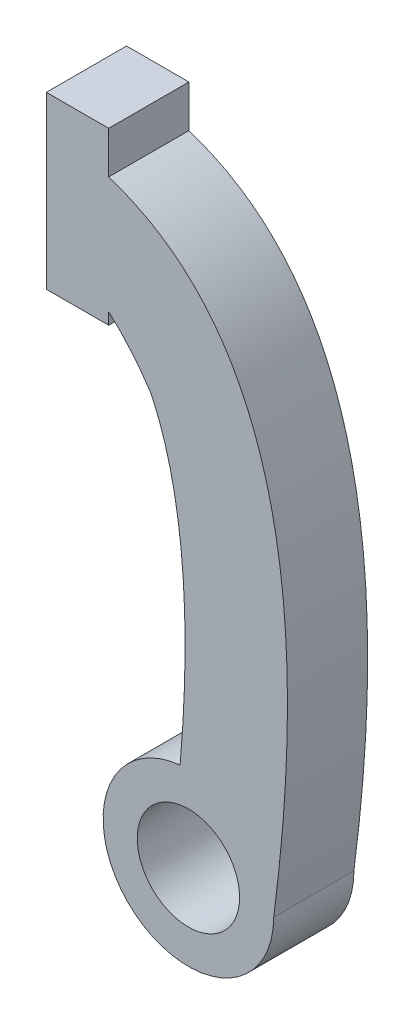
ISO-10303-21;
HEADER;
FILE_DESCRIPTION(('STEP AP214'),'2;1');
FILE_NAME('part.step','',(''),(''),'','','');
FILE_SCHEMA(('AUTOMOTIVE_DESIGN { 1 0 10303 214 1 1 1 1 }'));
ENDSEC;
DATA;
#1=APPLICATION_CONTEXT('core data for automotive mechanical design processes');
#2=APPLICATION_PROTOCOL_DEFINITION('international standard','automotive_design',2000,#1);
#3=PRODUCT_CONTEXT('',#1,'mechanical');
#4=PRODUCT('Part','Part','',(#3));
#5=PRODUCT_RELATED_PRODUCT_CATEGORY('part','',(#4));
#6=PRODUCT_DEFINITION_FORMATION('','',#4);
#7=PRODUCT_DEFINITION_CONTEXT('part definition',#1,'design');
#8=PRODUCT_DEFINITION('design','',#6,#7);
#9=PRODUCT_DEFINITION_SHAPE('','',#8);
#10=(LENGTH_UNIT() NAMED_UNIT(*) SI_UNIT(.MILLI.,.METRE.));
#11=(NAMED_UNIT(*) PLANE_ANGLE_UNIT() SI_UNIT($,.RADIAN.));
#12=(NAMED_UNIT(*) SI_UNIT($,.STERADIAN.) SOLID_ANGLE_UNIT());
#13=UNCERTAINTY_MEASURE_WITH_UNIT(LENGTH_MEASURE(1.E-05),#10,'distance_accuracy_value','');
#14=(GEOMETRIC_REPRESENTATION_CONTEXT(3) GLOBAL_UNCERTAINTY_ASSIGNED_CONTEXT((#13)) GLOBAL_UNIT_ASSIGNED_CONTEXT((#10,
#11,#12)) REPRESENTATION_CONTEXT('',''));
#15=CARTESIAN_POINT('',(0.,0.,0.));
#16=DIRECTION('',(0.,0.,1.));
#17=DIRECTION('',(1.,0.,0.));
#18=AXIS2_PLACEMENT_3D('',#15,#16,#17);
#19=CARTESIAN_POINT('',(-22.0822946516425,230.189836253695,47.));
#20=CARTESIAN_POINT('',(-40.6908836474442,258.14906543191,47.));
#21=CARTESIAN_POINT('',(-65.,272.119188354956,47.));
#22=B_SPLINE_CURVE_WITH_KNOTS('',2,(#19,#20,#21),.UNSPECIFIED.,.F.,.F.,(3,3),(0.,
0.333581844016435),.UNSPECIFIED.);
#23=DIRECTION('',(0.,0.,-1.));
#24=VECTOR('',#23,1.);
#25=SURFACE_OF_LINEAR_EXTRUSION('',#22,#24);
#26=CARTESIAN_POINT('',(-22.0822946516425,230.189836253695,0.));
#27=CARTESIAN_POINT('',(-40.6908836474442,258.14906543191,0.));
#28=CARTESIAN_POINT('',(-65.,272.119188354956,0.));
#29=B_SPLINE_CURVE_WITH_KNOTS('',2,(#26,#27,#28),.UNSPECIFIED.,.F.,.F.,(3,3),(0.,
0.333581844016435),.UNSPECIFIED.);
#30=CARTESIAN_POINT('',(-22.0822946516425,230.189836253695,0.));
#31=VERTEX_POINT('',#30);
#32=CARTESIAN_POINT('',(-46.727102690925,258.937140002278,0.));
#33=VERTEX_POINT('',#32);
#34=EDGE_CURVE('E138',#31,#33,#29,.T.);
#35=ORIENTED_EDGE('',*,*,#34,.F.);
#36=DIRECTION('',(0.,0.,-1.));
#37=VECTOR('',#36,1.);
#38=CARTESIAN_POINT('',(-22.0822946516425,230.189836253695,47.));
#39=LINE('',#38,#37);
#40=CARTESIAN_POINT('',(-22.0822946516425,230.189836253695,47.));
#41=VERTEX_POINT('',#40);
#42=EDGE_CURVE('E11',#41,#31,#39,.T.);
#43=ORIENTED_EDGE('',*,*,#42,.F.);
#44=CARTESIAN_POINT('',(-46.727102690925,258.937140002278,47.));
#45=VERTEX_POINT('',#44);
#46=EDGE_CURVE('E178',#41,#45,#22,.T.);
#47=ORIENTED_EDGE('',*,*,#46,.T.);
#48=DIRECTION('',(0.,0.,-1.));
#49=VECTOR('',#48,1.);
#50=CARTESIAN_POINT('',(-46.727102690925,258.937140002278,47.));
#51=LINE('',#50,#49);
#52=EDGE_CURVE('E51',#45,#33,#51,.T.);
#53=ORIENTED_EDGE('',*,*,#52,.T.);
#54=EDGE_LOOP('',(#35,#43,#47,#53));
#55=FACE_BOUND('',#54,.T.);
#56=ADVANCED_FACE('F34',(#55),#25,.T.);
#57=CARTESIAN_POINT('',(-9.49357337631064,7.77912121756313,47.));
#58=CARTESIAN_POINT('',(-9.27147188635676,9.47772070200445,47.));
#59=CARTESIAN_POINT('',(-8.83348745722547,12.8883812125781,47.));
#60=CARTESIAN_POINT('',(-8.0018303506311,19.6141984633931,47.));
#61=CARTESIAN_POINT('',(-7.03622253540502,27.9108070706155,47.));
#62=CARTESIAN_POINT('',(-5.99817104725146,37.6671472912994,47.));
#63=CARTESIAN_POINT('',(-4.77327923321823,50.4157577348247,47.));
#64=CARTESIAN_POINT('',(-3.53961801330322,65.8581203766924,47.));
#65=CARTESIAN_POINT('',(-2.52936637816039,83.5913905702309,47.));
#66=CARTESIAN_POINT('',(-1.98232047610912,100.516724073032,47.));
#67=CARTESIAN_POINT('',(-1.85878936172137,121.992140620998,47.));
#68=CARTESIAN_POINT('',(-2.8149789430919,146.760764163244,47.));
#69=CARTESIAN_POINT('',(-5.15688622075544,168.679611703463,47.));
#70=CARTESIAN_POINT('',(-7.77567131366234,184.458623380657,47.));
#71=CARTESIAN_POINT('',(-10.0839012903231,195.406366157599,47.));
#72=CARTESIAN_POINT('',(-12.7042918977025,205.462363582975,47.));
#73=CARTESIAN_POINT('',(-15.1176756212418,213.099806620311,47.));
#74=CARTESIAN_POINT('',(-17.1659673713187,218.768249547536,47.));
#75=CARTESIAN_POINT('',(-18.75625372079,222.802063426017,47.));
#76=CARTESIAN_POINT('',(-20.120456476122,225.981036835896,47.));
#77=CARTESIAN_POINT('',(-21.2365276539284,228.424580455262,47.));
#78=CARTESIAN_POINT('',(-21.7957330475991,229.599816850209,47.));
#79=CARTESIAN_POINT('',(-22.0822946516425,230.189836253695,47.));
#80=B_SPLINE_CURVE_WITH_KNOTS('',3,(#57,#58,#59,#60,#61,#62,#63,#64,#65,#66,#67,#68,#69,#70,#71,
#72,#73,#74,#75,#76,#77,#78,#79),.UNSPECIFIED.,.F.,.F.,(4,1,1,1,1,1,1,1,1,1,1,1,1,1,1,1,1,1,1,1,
4),(0.,0.00732301292553175,0.0146460258510635,0.029292051702127,0.0439380775531905,
0.058584103404254,0.087876155106381,0.117168206808508,0.146460258510635,0.175752310212762,
0.234336413617016,0.29292051702127,0.322212568723397,0.351504620425524,0.380796672127651,
0.410088723829778,0.424734749680841,0.439380775531905,0.454026801382968,0.4613498143085,
0.468672827234032),.UNSPECIFIED.);
#81=DIRECTION('',(0.,0.,-1.));
#82=VECTOR('',#81,1.);
#83=SURFACE_OF_LINEAR_EXTRUSION('',#80,#82);
#84=CARTESIAN_POINT('',(-9.49357337631064,7.77912121756313,0.));
#85=CARTESIAN_POINT('',(-9.27147188635676,9.47772070200445,0.));
#86=CARTESIAN_POINT('',(-8.83348745722547,12.8883812125781,0.));
#87=CARTESIAN_POINT('',(-8.0018303506311,19.6141984633931,0.));
#88=CARTESIAN_POINT('',(-7.03622253540502,27.9108070706155,0.));
#89=CARTESIAN_POINT('',(-5.99817104725146,37.6671472912994,0.));
#90=CARTESIAN_POINT('',(-4.77327923321823,50.4157577348247,0.));
#91=CARTESIAN_POINT('',(-3.53961801330322,65.8581203766924,0.));
#92=CARTESIAN_POINT('',(-2.52936637816039,83.5913905702309,0.));
#93=CARTESIAN_POINT('',(-1.98232047610912,100.516724073032,0.));
#94=CARTESIAN_POINT('',(-1.85878936172137,121.992140620998,0.));
#95=CARTESIAN_POINT('',(-2.8149789430919,146.760764163244,0.));
#96=CARTESIAN_POINT('',(-5.15688622075544,168.679611703463,0.));
#97=CARTESIAN_POINT('',(-7.77567131366234,184.458623380657,0.));
#98=CARTESIAN_POINT('',(-10.0839012903231,195.406366157599,0.));
#99=CARTESIAN_POINT('',(-12.7042918977025,205.462363582975,0.));
#100=CARTESIAN_POINT('',(-15.1176756212418,213.099806620311,0.));
#101=CARTESIAN_POINT('',(-17.1659673713187,218.768249547536,0.));
#102=CARTESIAN_POINT('',(-18.75625372079,222.802063426017,0.));
#103=CARTESIAN_POINT('',(-20.120456476122,225.981036835896,0.));
#104=CARTESIAN_POINT('',(-21.2365276539284,228.424580455262,0.));
#105=CARTESIAN_POINT('',(-21.7957330475991,229.599816850209,0.));
#106=CARTESIAN_POINT('',(-22.0822946516425,230.189836253695,0.));
#107=B_SPLINE_CURVE_WITH_KNOTS('',3,(#84,#85,#86,#87,#88,#89,#90,#91,#92,#93,#94,#95,#96,#97,
#98,#99,#100,#101,#102,#103,#104,#105,#106),.UNSPECIFIED.,.F.,.F.,(4,1,1,1,1,1,1,1,1,1,1,1,1,1,
1,1,1,1,1,1,4),(0.,0.00732301292553175,0.0146460258510635,0.029292051702127,0.0439380775531905,
0.058584103404254,0.087876155106381,0.117168206808508,0.146460258510635,0.175752310212762,
0.234336413617016,0.29292051702127,0.322212568723397,0.351504620425524,0.380796672127651,
0.410088723829778,0.424734749680841,0.439380775531905,0.454026801382968,0.4613498143085,
0.468672827234032),.UNSPECIFIED.);
#108=CARTESIAN_POINT('',(-4.87003674115848,49.7622622289197,0.));
#109=VERTEX_POINT('',#108);
#110=EDGE_CURVE('E142',#109,#31,#107,.T.);
#111=ORIENTED_EDGE('',*,*,#110,.F.);
#112=DIRECTION('',(0.,0.,-1.));
#113=VECTOR('',#112,1.);
#114=CARTESIAN_POINT('',(-4.87003674115848,49.7622622289197,47.));
#115=LINE('',#114,#113);
#116=CARTESIAN_POINT('',(-4.87003674115848,49.7622622289197,47.));
#117=VERTEX_POINT('',#116);
#118=EDGE_CURVE('E43',#117,#109,#115,.T.);
#119=ORIENTED_EDGE('',*,*,#118,.F.);
#120=EDGE_CURVE('E203',#117,#41,#80,.T.);
#121=ORIENTED_EDGE('',*,*,#120,.T.);
#122=ORIENTED_EDGE('',*,*,#42,.T.);
#123=EDGE_LOOP('',(#111,#119,#121,#122));
#124=FACE_BOUND('',#123,.T.);
#125=ADVANCED_FACE('F202',(#124),#83,.T.);
#126=CARTESIAN_POINT('',(0.,0.,47.));
#127=DIRECTION('',(0.,0.,-1.));
#128=DIRECTION('',(-1.,0.,0.));
#129=AXIS2_PLACEMENT_3D('',#126,#127,#128);
#130=CYLINDRICAL_SURFACE('',#129,50.);
#131=CARTESIAN_POINT('',(0.,0.,0.));
#132=DIRECTION('',(0.,0.,1.));
#133=DIRECTION('',(1.,0.,0.));
#134=AXIS2_PLACEMENT_3D('',#131,#132,#133);
#135=CIRCLE('',#134,50.);
#136=CARTESIAN_POINT('',(50.,0.,0.));
#137=VERTEX_POINT('',#136);
#138=EDGE_CURVE('E150',#109,#137,#135,.T.);
#139=ORIENTED_EDGE('',*,*,#138,.T.);
#140=DIRECTION('',(0.,0.,-1.));
#141=VECTOR('',#140,1.);
#142=CARTESIAN_POINT('',(50.,0.,47.));
#143=LINE('',#142,#141);
#144=CARTESIAN_POINT('',(50.,0.,47.));
#145=VERTEX_POINT('',#144);
#146=EDGE_CURVE('E186',#145,#137,#143,.T.);
#147=ORIENTED_EDGE('',*,*,#146,.F.);
#148=CARTESIAN_POINT('',(0.,0.,47.));
#149=DIRECTION('',(0.,0.,1.));
#150=DIRECTION('',(1.,0.,0.));
#151=AXIS2_PLACEMENT_3D('',#148,#149,#150);
#152=CIRCLE('',#151,50.);
#153=EDGE_CURVE('E193',#117,#145,#152,.T.);
#154=ORIENTED_EDGE('',*,*,#153,.F.);
#155=ORIENTED_EDGE('',*,*,#118,.T.);
#156=EDGE_LOOP('',(#139,#147,#154,#155));
#157=FACE_BOUND('',#156,.T.);
#158=ADVANCED_FACE('F191',(#157),#130,.T.);
#159=CARTESIAN_POINT('',(50.,0.,47.));
#160=CARTESIAN_POINT('',(89.5387574223994,302.386593566226,47.));
#161=CARTESIAN_POINT('',(-65.,332.119188354956,47.));
#162=B_SPLINE_CURVE_WITH_KNOTS('',2,(#159,#160,#161),.UNSPECIFIED.,.F.,.F.,(3,3),(0.,
0.820922678231939),.UNSPECIFIED.);
#163=DIRECTION('',(0.,0.,-1.));
#164=VECTOR('',#163,1.);
#165=SURFACE_OF_LINEAR_EXTRUSION('',#162,#164);
#166=CARTESIAN_POINT('',(50.,0.,0.));
#167=CARTESIAN_POINT('',(89.5387574223994,302.386593566226,0.));
#168=CARTESIAN_POINT('',(-65.,332.119188354956,0.));
#169=B_SPLINE_CURVE_WITH_KNOTS('',2,(#166,#167,#168),.UNSPECIFIED.,.F.,.F.,(3,3),(0.,
0.820922678231939),.UNSPECIFIED.);
#170=CARTESIAN_POINT('',(-46.727102690925,327.431264090719,0.));
#171=VERTEX_POINT('',#170);
#172=EDGE_CURVE('E155',#137,#171,#169,.T.);
#173=ORIENTED_EDGE('',*,*,#172,.T.);
#174=DIRECTION('',(0.,0.,-1.));
#175=VECTOR('',#174,1.);
#176=CARTESIAN_POINT('',(-46.727102690925,327.431264090719,47.));
#177=LINE('',#176,#175);
#178=CARTESIAN_POINT('',(-46.727102690925,327.431264090719,47.));
#179=VERTEX_POINT('',#178);
#180=EDGE_CURVE('E184',#179,#171,#177,.T.);
#181=ORIENTED_EDGE('',*,*,#180,.F.);
#182=EDGE_CURVE('E237',#145,#179,#162,.T.);
#183=ORIENTED_EDGE('',*,*,#182,.F.);
#184=ORIENTED_EDGE('',*,*,#146,.T.);
#185=EDGE_LOOP('',(#173,#181,#183,#184));
#186=FACE_BOUND('',#185,.T.);
#187=ADVANCED_FACE('F222',(#186),#165,.F.);
#188=CARTESIAN_POINT('',(-46.727102690925,0.,47.));
#189=DIRECTION('',(1.,0.,0.));
#190=DIRECTION('',(0.,0.,-1.));
#191=AXIS2_PLACEMENT_3D('',#188,#189,#190);
#192=PLANE('',#191);
#193=DIRECTION('',(0.,-1.,0.));
#194=VECTOR('',#193,1.);
#195=CARTESIAN_POINT('',(-46.727102690925,0.,0.));
#196=LINE('',#195,#194);
#197=CARTESIAN_POINT('',(-46.727102690925,352.119188354928,0.));
#198=VERTEX_POINT('',#197);
#199=EDGE_CURVE('E160',#198,#171,#196,.T.);
#200=ORIENTED_EDGE('',*,*,#199,.F.);
#201=DIRECTION('',(0.,0.,-1.));
#202=VECTOR('',#201,1.);
#203=CARTESIAN_POINT('',(-46.727102690925,352.119188354928,47.));
#204=LINE('',#203,#202);
#205=CARTESIAN_POINT('',(-46.727102690925,352.119188354928,47.));
#206=VERTEX_POINT('',#205);
#207=EDGE_CURVE('E182',#206,#198,#204,.T.);
#208=ORIENTED_EDGE('',*,*,#207,.F.);
#209=DIRECTION('',(0.,-1.,0.));
#210=VECTOR('',#209,1.);
#211=CARTESIAN_POINT('',(-46.727102690925,0.,47.));
#212=LINE('',#211,#210);
#213=EDGE_CURVE('E242',#206,#179,#212,.T.);
#214=ORIENTED_EDGE('',*,*,#213,.T.);
#215=ORIENTED_EDGE('',*,*,#180,.T.);
#216=EDGE_LOOP('',(#200,#208,#214,#215));
#217=FACE_BOUND('',#216,.T.);
#218=ADVANCED_FACE('F248',(#217),#192,.T.);
#219=CARTESIAN_POINT('',(0.,352.119188354928,47.));
#220=DIRECTION('',(0.,1.,0.));
#221=DIRECTION('',(0.,0.,1.));
#222=AXIS2_PLACEMENT_3D('',#219,#220,#221);
#223=PLANE('',#222);
#224=DIRECTION('',(1.,0.,0.));
#225=VECTOR('',#224,1.);
#226=CARTESIAN_POINT('',(0.,352.119188354928,0.));
#227=LINE('',#226,#225);
#228=CARTESIAN_POINT('',(-83.272897309075,352.119188354928,0.));
#229=VERTEX_POINT('',#228);
#230=EDGE_CURVE('E166',#229,#198,#227,.T.);
#231=ORIENTED_EDGE('',*,*,#230,.F.);
#232=DIRECTION('',(0.,0.,-1.));
#233=VECTOR('',#232,1.);
#234=CARTESIAN_POINT('',(-83.272897309075,352.119188354928,47.));
#235=LINE('',#234,#233);
#236=CARTESIAN_POINT('',(-83.272897309075,352.119188354928,47.));
#237=VERTEX_POINT('',#236);
#238=EDGE_CURVE('E127',#237,#229,#235,.T.);
#239=ORIENTED_EDGE('',*,*,#238,.F.);
#240=DIRECTION('',(1.,0.,0.));
#241=VECTOR('',#240,1.);
#242=CARTESIAN_POINT('',(0.,352.119188354928,47.));
#243=LINE('',#242,#241);
#244=EDGE_CURVE('E117',#237,#206,#243,.T.);
#245=ORIENTED_EDGE('',*,*,#244,.T.);
#246=ORIENTED_EDGE('',*,*,#207,.T.);
#247=EDGE_LOOP('',(#231,#239,#245,#246));
#248=FACE_BOUND('',#247,.T.);
#249=ADVANCED_FACE('F252',(#248),#223,.T.);
#250=CARTESIAN_POINT('',(-83.272897309075,0.,47.));
#251=DIRECTION('',(1.,0.,0.));
#252=DIRECTION('',(0.,0.,-1.));
#253=AXIS2_PLACEMENT_3D('',#250,#251,#252);
#254=PLANE('',#253);
#255=DIRECTION('',(0.,-1.,0.));
#256=VECTOR('',#255,1.);
#257=CARTESIAN_POINT('',(-83.272897309075,0.,0.));
#258=LINE('',#257,#256);
#259=CARTESIAN_POINT('',(-83.272897309075,252.119188354928,0.));
#260=VERTEX_POINT('',#259);
#261=EDGE_CURVE('E124',#229,#260,#258,.T.);
#262=ORIENTED_EDGE('',*,*,#261,.T.);
#263=DIRECTION('',(0.,0.,-1.));
#264=VECTOR('',#263,1.);
#265=CARTESIAN_POINT('',(-83.272897309075,252.119188354928,47.));
#266=LINE('',#265,#264);
#267=CARTESIAN_POINT('',(-83.272897309075,252.119188354928,47.));
#268=VERTEX_POINT('',#267);
#269=EDGE_CURVE('E121',#268,#260,#266,.T.);
#270=ORIENTED_EDGE('',*,*,#269,.F.);
#271=DIRECTION('',(0.,-1.,0.));
#272=VECTOR('',#271,1.);
#273=CARTESIAN_POINT('',(-83.272897309075,0.,47.));
#274=LINE('',#273,#272);
#275=EDGE_CURVE('E108',#237,#268,#274,.T.);
#276=ORIENTED_EDGE('',*,*,#275,.F.);
#277=ORIENTED_EDGE('',*,*,#238,.T.);
#278=EDGE_LOOP('',(#262,#270,#276,#277));
#279=FACE_BOUND('',#278,.T.);
#280=ADVANCED_FACE('F122',(#279),#254,.F.);
#281=CARTESIAN_POINT('',(0.,252.119188354928,47.));
#282=DIRECTION('',(0.,1.,0.));
#283=DIRECTION('',(0.,0.,1.));
#284=AXIS2_PLACEMENT_3D('',#281,#282,#283);
#285=PLANE('',#284);
#286=DIRECTION('',(1.,0.,0.));
#287=VECTOR('',#286,1.);
#288=CARTESIAN_POINT('',(0.,252.119188354928,0.));
#289=LINE('',#288,#287);
#290=CARTESIAN_POINT('',(-46.727102690925,252.119188354928,0.));
#291=VERTEX_POINT('',#290);
#292=EDGE_CURVE('E170',#260,#291,#289,.T.);
#293=ORIENTED_EDGE('',*,*,#292,.T.);
#294=DIRECTION('',(0.,0.,-1.));
#295=VECTOR('',#294,1.);
#296=CARTESIAN_POINT('',(-46.727102690925,252.119188354928,47.));
#297=LINE('',#296,#295);
#298=CARTESIAN_POINT('',(-46.727102690925,252.119188354928,47.));
#299=VERTEX_POINT('',#298);
#300=EDGE_CURVE('E80',#299,#291,#297,.T.);
#301=ORIENTED_EDGE('',*,*,#300,.F.);
#302=DIRECTION('',(1.,0.,0.));
#303=VECTOR('',#302,1.);
#304=CARTESIAN_POINT('',(0.,252.119188354928,47.));
#305=LINE('',#304,#303);
#306=EDGE_CURVE('E114',#268,#299,#305,.T.);
#307=ORIENTED_EDGE('',*,*,#306,.F.);
#308=ORIENTED_EDGE('',*,*,#269,.T.);
#309=EDGE_LOOP('',(#293,#301,#307,#308));
#310=FACE_BOUND('',#309,.T.);
#311=ADVANCED_FACE('F129',(#310),#285,.F.);
#312=CARTESIAN_POINT('',(-46.727102690925,0.,47.));
#313=DIRECTION('',(1.,0.,0.));
#314=DIRECTION('',(0.,0.,-1.));
#315=AXIS2_PLACEMENT_3D('',#312,#313,#314);
#316=PLANE('',#315);
#317=DIRECTION('',(0.,-1.,0.));
#318=VECTOR('',#317,1.);
#319=CARTESIAN_POINT('',(-46.727102690925,0.,0.));
#320=LINE('',#319,#318);
#321=EDGE_CURVE('E172',#33,#291,#320,.T.);
#322=ORIENTED_EDGE('',*,*,#321,.F.);
#323=ORIENTED_EDGE('',*,*,#52,.F.);
#324=DIRECTION('',(0.,-1.,0.));
#325=VECTOR('',#324,1.);
#326=CARTESIAN_POINT('',(-46.727102690925,0.,47.));
#327=LINE('',#326,#325);
#328=EDGE_CURVE('E130',#45,#299,#327,.T.);
#329=ORIENTED_EDGE('',*,*,#328,.T.);
#330=ORIENTED_EDGE('',*,*,#300,.T.);
#331=EDGE_LOOP('',(#322,#323,#329,#330));
#332=FACE_BOUND('',#331,.T.);
#333=ADVANCED_FACE('F204',(#332),#316,.T.);
#334=CARTESIAN_POINT('',(0.,0.,47.));
#335=DIRECTION('',(0.,0.,-1.));
#336=DIRECTION('',(-1.,0.,0.));
#337=AXIS2_PLACEMENT_3D('',#334,#335,#336);
#338=CYLINDRICAL_SURFACE('',#337,30.);
#339=CARTESIAN_POINT('',(0.,0.,47.));
#340=DIRECTION('',(0.,0.,1.));
#341=DIRECTION('',(1.,0.,0.));
#342=AXIS2_PLACEMENT_3D('',#339,#340,#341);
#343=CIRCLE('',#342,30.);
#344=CARTESIAN_POINT('',(30.,0.,47.));
#345=VERTEX_POINT('',#344);
#346=EDGE_CURVE('E132',#345,#345,#343,.T.);
#347=ORIENTED_EDGE('',*,*,#346,.T.);
#348=EDGE_LOOP('',(#347));
#349=FACE_BOUND('',#348,.T.);
#350=CARTESIAN_POINT('',(0.,0.,0.));
#351=DIRECTION('',(0.,0.,1.));
#352=DIRECTION('',(1.,0.,0.));
#353=AXIS2_PLACEMENT_3D('',#350,#351,#352);
#354=CIRCLE('',#353,30.);
#355=CARTESIAN_POINT('',(30.,0.,0.));
#356=VERTEX_POINT('',#355);
#357=EDGE_CURVE('E175',#356,#356,#354,.T.);
#358=ORIENTED_EDGE('',*,*,#357,.F.);
#359=EDGE_LOOP('',(#358));
#360=FACE_BOUND('',#359,.T.);
#361=ADVANCED_FACE('F206',(#349,#360),#338,.F.);
#362=CARTESIAN_POINT('',(0.,0.,47.));
#363=DIRECTION('',(0.,0.,1.));
#364=DIRECTION('',(1.,0.,0.));
#365=AXIS2_PLACEMENT_3D('',#362,#363,#364);
#366=PLANE('',#365);
#367=ORIENTED_EDGE('',*,*,#46,.F.);
#368=ORIENTED_EDGE('',*,*,#120,.F.);
#369=ORIENTED_EDGE('',*,*,#153,.T.);
#370=ORIENTED_EDGE('',*,*,#182,.T.);
#371=ORIENTED_EDGE('',*,*,#213,.F.);
#372=ORIENTED_EDGE('',*,*,#244,.F.);
#373=ORIENTED_EDGE('',*,*,#275,.T.);
#374=ORIENTED_EDGE('',*,*,#306,.T.);
#375=ORIENTED_EDGE('',*,*,#328,.F.);
#376=EDGE_LOOP('',(#367,#368,#369,#370,#371,#372,#373,#374,#375));
#377=FACE_BOUND('',#376,.T.);
#378=ORIENTED_EDGE('',*,*,#346,.F.);
#379=EDGE_LOOP('',(#378));
#380=FACE_BOUND('',#379,.T.);
#381=ADVANCED_FACE('F110',(#377,#380),#366,.T.);
#382=CARTESIAN_POINT('',(0.,0.,0.));
#383=DIRECTION('',(0.,0.,1.));
#384=DIRECTION('',(1.,0.,0.));
#385=AXIS2_PLACEMENT_3D('',#382,#383,#384);
#386=PLANE('',#385);
#387=ORIENTED_EDGE('',*,*,#34,.T.);
#388=ORIENTED_EDGE('',*,*,#321,.T.);
#389=ORIENTED_EDGE('',*,*,#292,.F.);
#390=ORIENTED_EDGE('',*,*,#261,.F.);
#391=ORIENTED_EDGE('',*,*,#230,.T.);
#392=ORIENTED_EDGE('',*,*,#199,.T.);
#393=ORIENTED_EDGE('',*,*,#172,.F.);
#394=ORIENTED_EDGE('',*,*,#138,.F.);
#395=ORIENTED_EDGE('',*,*,#110,.T.);
#396=EDGE_LOOP('',(#387,#388,#389,#390,#391,#392,#393,#394,#395));
#397=FACE_BOUND('',#396,.T.);
#398=ORIENTED_EDGE('',*,*,#357,.T.);
#399=EDGE_LOOP('',(#398));
#400=FACE_BOUND('',#399,.T.);
#401=ADVANCED_FACE('F200',(#397,#400),#386,.F.);
#402=CLOSED_SHELL('',(#56,#125,#158,#187,#218,#249,#280,#311,#333,#361,#381,#401));
#403=MANIFOLD_SOLID_BREP('B2',#402);
#404=ADVANCED_BREP_SHAPE_REPRESENTATION('',(#18,#403),#14);
#405=SHAPE_DEFINITION_REPRESENTATION(#9,#404);
ENDSEC;
END-ISO-10303-21;
